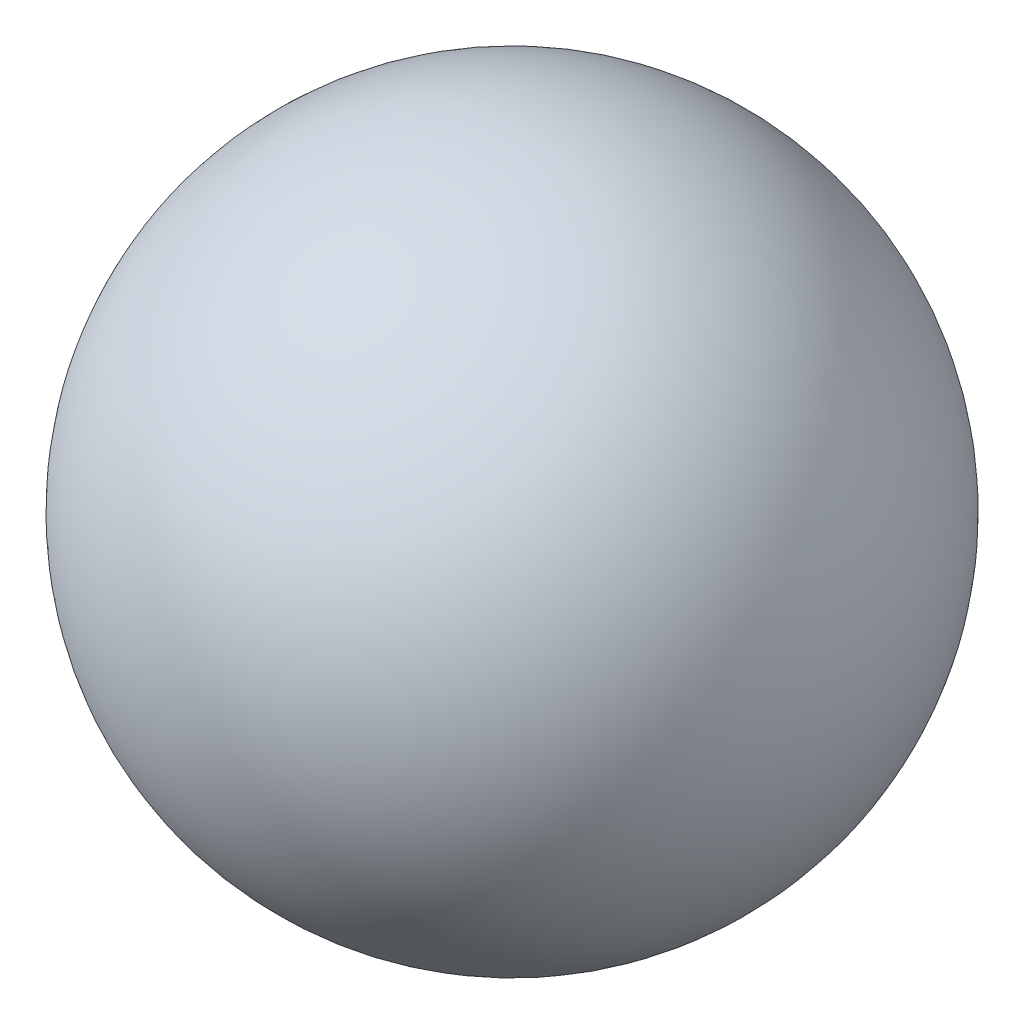
ISO-10303-21;
HEADER;
FILE_DESCRIPTION(('STEP AP214'),'2;1');
FILE_NAME('part.step','',(''),(''),'','','');
FILE_SCHEMA(('AUTOMOTIVE_DESIGN { 1 0 10303 214 1 1 1 1 }'));
ENDSEC;
DATA;
#1=APPLICATION_CONTEXT('core data for automotive mechanical design processes');
#2=APPLICATION_PROTOCOL_DEFINITION('international standard','automotive_design',2000,#1);
#3=PRODUCT_CONTEXT('',#1,'mechanical');
#4=PRODUCT('Part','Part','',(#3));
#5=PRODUCT_RELATED_PRODUCT_CATEGORY('part','',(#4));
#6=PRODUCT_DEFINITION_FORMATION('','',#4);
#7=PRODUCT_DEFINITION_CONTEXT('part definition',#1,'design');
#8=PRODUCT_DEFINITION('design','',#6,#7);
#9=PRODUCT_DEFINITION_SHAPE('','',#8);
#10=(LENGTH_UNIT() NAMED_UNIT(*) SI_UNIT(.MILLI.,.METRE.));
#11=(NAMED_UNIT(*) PLANE_ANGLE_UNIT() SI_UNIT($,.RADIAN.));
#12=(NAMED_UNIT(*) SI_UNIT($,.STERADIAN.) SOLID_ANGLE_UNIT());
#13=UNCERTAINTY_MEASURE_WITH_UNIT(LENGTH_MEASURE(1.E-05),#10,'distance_accuracy_value','');
#14=(GEOMETRIC_REPRESENTATION_CONTEXT(3) GLOBAL_UNCERTAINTY_ASSIGNED_CONTEXT((#13)) GLOBAL_UNIT_ASSIGNED_CONTEXT((#10,
#11,#12)) REPRESENTATION_CONTEXT('',''));
#15=CARTESIAN_POINT('',(0.,0.,0.));
#16=DIRECTION('',(0.,0.,1.));
#17=DIRECTION('',(1.,0.,0.));
#18=AXIS2_PLACEMENT_3D('',#15,#16,#17);
#19=CARTESIAN_POINT('',(0.,0.,0.));
#20=DIRECTION('',(1.,0.,0.));
#21=DIRECTION('',(0.,1.,0.));
#22=AXIS2_PLACEMENT_3D('',#19,#20,#21);
#23=SPHERICAL_SURFACE('',#22,0.52500022);
#24=CARTESIAN_POINT('',(-0.52500022,0.,0.));
#25=VERTEX_POINT('',#24);
#26=VERTEX_LOOP('',#25);
#27=FACE_BOUND('',#26,.T.);
#28=CARTESIAN_POINT('',(0.52500022,0.,0.));
#29=VERTEX_POINT('',#28);
#30=VERTEX_LOOP('',#29);
#31=FACE_BOUND('',#30,.T.);
#32=ADVANCED_FACE('F16',(#27,#31),#23,.T.);
#33=CLOSED_SHELL('',(#32));
#34=MANIFOLD_SOLID_BREP('B1',#33);
#35=ADVANCED_BREP_SHAPE_REPRESENTATION('',(#18,#34),#14);
#36=SHAPE_DEFINITION_REPRESENTATION(#9,#35);
ENDSEC;
END-ISO-10303-21;
